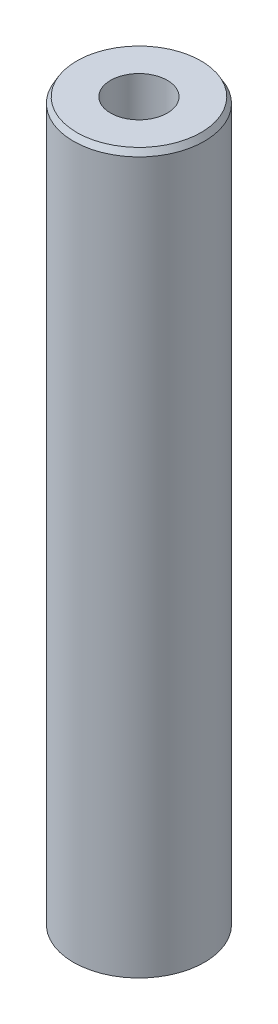
ISO-10303-21;
HEADER;
FILE_DESCRIPTION(('STEP AP214'),'2;1');
FILE_NAME('part.step','',(''),(''),'','','');
FILE_SCHEMA(('AUTOMOTIVE_DESIGN { 1 0 10303 214 1 1 1 1 }'));
ENDSEC;
DATA;
#1=APPLICATION_CONTEXT('core data for automotive mechanical design processes');
#2=APPLICATION_PROTOCOL_DEFINITION('international standard','automotive_design',2000,#1);
#3=PRODUCT_CONTEXT('',#1,'mechanical');
#4=PRODUCT('Part','Part','',(#3));
#5=PRODUCT_RELATED_PRODUCT_CATEGORY('part','',(#4));
#6=PRODUCT_DEFINITION_FORMATION('','',#4);
#7=PRODUCT_DEFINITION_CONTEXT('part definition',#1,'design');
#8=PRODUCT_DEFINITION('design','',#6,#7);
#9=PRODUCT_DEFINITION_SHAPE('','',#8);
#10=(LENGTH_UNIT() NAMED_UNIT(*) SI_UNIT(.MILLI.,.METRE.));
#11=(NAMED_UNIT(*) PLANE_ANGLE_UNIT() SI_UNIT($,.RADIAN.));
#12=(NAMED_UNIT(*) SI_UNIT($,.STERADIAN.) SOLID_ANGLE_UNIT());
#13=UNCERTAINTY_MEASURE_WITH_UNIT(LENGTH_MEASURE(1.E-05),#10,'distance_accuracy_value','');
#14=(GEOMETRIC_REPRESENTATION_CONTEXT(3) GLOBAL_UNCERTAINTY_ASSIGNED_CONTEXT((#13)) GLOBAL_UNIT_ASSIGNED_CONTEXT((#10,
#11,#12)) REPRESENTATION_CONTEXT('',''));
#15=CARTESIAN_POINT('',(0.,0.,0.));
#16=DIRECTION('',(0.,0.,1.));
#17=DIRECTION('',(1.,0.,0.));
#18=AXIS2_PLACEMENT_3D('',#15,#16,#17);
#19=CARTESIAN_POINT('',(0.,82.5000004998071,0.));
#20=DIRECTION('',(0.,-1.,0.));
#21=DIRECTION('',(0.,0.,-1.));
#22=AXIS2_PLACEMENT_3D('',#19,#20,#21);
#23=CYLINDRICAL_SURFACE('',#22,7.5);
#24=CARTESIAN_POINT('',(0.,81.8284571455017,0.));
#25=DIRECTION('',(0.,1.,0.));
#26=DIRECTION('',(0.,0.,1.));
#27=AXIS2_PLACEMENT_3D('',#24,#25,#26);
#28=CIRCLE('',#27,7.5);
#29=CARTESIAN_POINT('',(0.,81.8284571455017,7.5));
#30=VERTEX_POINT('',#29);
#31=EDGE_CURVE('E50',#30,#30,#28,.F.);
#32=ORIENTED_EDGE('',*,*,#31,.T.);
#33=EDGE_LOOP('',(#32));
#34=FACE_BOUND('',#33,.T.);
#35=CARTESIAN_POINT('',(0.,0.387715736380731,0.));
#36=DIRECTION('',(0.,1.,0.));
#37=DIRECTION('',(0.,0.,1.));
#38=AXIS2_PLACEMENT_3D('',#35,#36,#37);
#39=CIRCLE('',#38,7.5);
#40=CARTESIAN_POINT('',(0.,0.387715736380731,7.5));
#41=VERTEX_POINT('',#40);
#42=EDGE_CURVE('E51',#41,#41,#39,.T.);
#43=ORIENTED_EDGE('',*,*,#42,.T.);
#44=EDGE_LOOP('',(#43));
#45=FACE_BOUND('',#44,.T.);
#46=ADVANCED_FACE('F39',(#34,#45),#23,.T.);
#47=CARTESIAN_POINT('',(0.,82.5000004998071,0.));
#48=DIRECTION('',(0.,1.,0.));
#49=DIRECTION('',(0.,0.,1.));
#50=AXIS2_PLACEMENT_3D('',#47,#48,#49);
#51=PLANE('',#50);
#52=CARTESIAN_POINT('',(0.,82.5000004998071,0.));
#53=DIRECTION('',(0.,1.,0.));
#54=DIRECTION('',(0.,0.,1.));
#55=AXIS2_PLACEMENT_3D('',#52,#53,#54);
#56=CIRCLE('',#55,7.11228426361926);
#57=CARTESIAN_POINT('',(0.,82.5000004998071,7.11228426361926));
#58=VERTEX_POINT('',#57);
#59=EDGE_CURVE('E54',#58,#58,#56,.T.);
#60=ORIENTED_EDGE('',*,*,#59,.T.);
#61=EDGE_LOOP('',(#60));
#62=FACE_BOUND('',#61,.T.);
#63=CARTESIAN_POINT('',(0.,82.5000004998071,0.));
#64=DIRECTION('',(0.,1.,0.));
#65=DIRECTION('',(0.,0.,1.));
#66=AXIS2_PLACEMENT_3D('',#63,#64,#65);
#67=CIRCLE('',#66,3.25149703943629);
#68=CARTESIAN_POINT('',(0.,82.5000004998071,3.25149703943629));
#69=VERTEX_POINT('',#68);
#70=EDGE_CURVE('E58',#69,#69,#67,.T.);
#71=ORIENTED_EDGE('',*,*,#70,.F.);
#72=EDGE_LOOP('',(#71));
#73=FACE_BOUND('',#72,.T.);
#74=ADVANCED_FACE('F69',(#62,#73),#51,.T.);
#75=CARTESIAN_POINT('',(0.,0.,0.));
#76=DIRECTION('',(0.,1.,0.));
#77=DIRECTION('',(0.,0.,1.));
#78=AXIS2_PLACEMENT_3D('',#75,#76,#77);
#79=PLANE('',#78);
#80=CARTESIAN_POINT('',(0.,0.,0.));
#81=DIRECTION('',(0.,1.,0.));
#82=DIRECTION('',(0.,0.,1.));
#83=AXIS2_PLACEMENT_3D('',#80,#81,#82);
#84=CIRCLE('',#83,6.82845664569458);
#85=CARTESIAN_POINT('',(0.,0.,6.82845664569458));
#86=VERTEX_POINT('',#85);
#87=EDGE_CURVE('E10',#86,#86,#84,.F.);
#88=ORIENTED_EDGE('',*,*,#87,.T.);
#89=EDGE_LOOP('',(#88));
#90=FACE_BOUND('',#89,.T.);
#91=CARTESIAN_POINT('',(0.,0.,0.));
#92=DIRECTION('',(0.,1.,0.));
#93=DIRECTION('',(0.,0.,1.));
#94=AXIS2_PLACEMENT_3D('',#91,#92,#93);
#95=CIRCLE('',#94,3.25149703943629);
#96=CARTESIAN_POINT('',(0.,0.,3.25149703943629));
#97=VERTEX_POINT('',#96);
#98=EDGE_CURVE('E63',#97,#97,#95,.T.);
#99=ORIENTED_EDGE('',*,*,#98,.T.);
#100=EDGE_LOOP('',(#99));
#101=FACE_BOUND('',#100,.T.);
#102=ADVANCED_FACE('F75',(#90,#101),#79,.F.);
#103=CARTESIAN_POINT('',(0.,82.5000004998071,0.));
#104=DIRECTION('',(0.,-1.,0.));
#105=DIRECTION('',(0.,0.,-1.));
#106=AXIS2_PLACEMENT_3D('',#103,#104,#105);
#107=CYLINDRICAL_SURFACE('',#106,3.25149703943629);
#108=ORIENTED_EDGE('',*,*,#70,.T.);
#109=EDGE_LOOP('',(#108));
#110=FACE_BOUND('',#109,.T.);
#111=ORIENTED_EDGE('',*,*,#98,.F.);
#112=EDGE_LOOP('',(#111));
#113=FACE_BOUND('',#112,.T.);
#114=ADVANCED_FACE('F70',(#110,#113),#107,.F.);
#115=CARTESIAN_POINT('',(0.,82.5000004998071,0.));
#116=DIRECTION('',(0.,-1.,0.));
#117=DIRECTION('',(0.,0.,-1.));
#118=AXIS2_PLACEMENT_3D('',#115,#116,#117);
#119=CONICAL_SURFACE('',#118,7.11228426361926,0.523598775598292);
#120=ORIENTED_EDGE('',*,*,#31,.F.);
#121=EDGE_LOOP('',(#120));
#122=FACE_BOUND('',#121,.T.);
#123=ORIENTED_EDGE('',*,*,#59,.F.);
#124=EDGE_LOOP('',(#123));
#125=FACE_BOUND('',#124,.T.);
#126=ADVANCED_FACE('F81',(#122,#125),#119,.T.);
#127=CARTESIAN_POINT('',(0.,0.387715736380731,0.));
#128=DIRECTION('',(0.,1.,0.));
#129=DIRECTION('',(0.,0.,1.));
#130=AXIS2_PLACEMENT_3D('',#127,#128,#129);
#131=CONICAL_SURFACE('',#130,7.5,1.04719755119661);
#132=ORIENTED_EDGE('',*,*,#87,.F.);
#133=EDGE_LOOP('',(#132));
#134=FACE_BOUND('',#133,.T.);
#135=ORIENTED_EDGE('',*,*,#42,.F.);
#136=EDGE_LOOP('',(#135));
#137=FACE_BOUND('',#136,.T.);
#138=ADVANCED_FACE('F45',(#134,#137),#131,.T.);
#139=CLOSED_SHELL('',(#46,#74,#102,#114,#126,#138));
#140=MANIFOLD_SOLID_BREP('B2',#139);
#141=ADVANCED_BREP_SHAPE_REPRESENTATION('',(#18,#140),#14);
#142=SHAPE_DEFINITION_REPRESENTATION(#9,#141);
ENDSEC;
END-ISO-10303-21;
